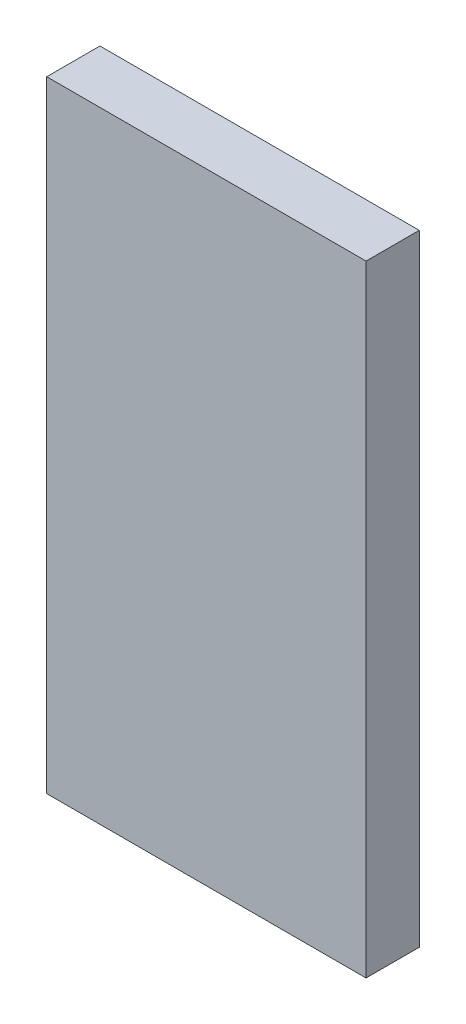
ISO-10303-21;
HEADER;
FILE_DESCRIPTION(('STEP AP214'),'2;1');
FILE_NAME('part.step','',(''),(''),'','','');
FILE_SCHEMA(('AUTOMOTIVE_DESIGN { 1 0 10303 214 1 1 1 1 }'));
ENDSEC;
DATA;
#1=APPLICATION_CONTEXT('core data for automotive mechanical design processes');
#2=APPLICATION_PROTOCOL_DEFINITION('international standard','automotive_design',2000,#1);
#3=PRODUCT_CONTEXT('',#1,'mechanical');
#4=PRODUCT('Part','Part','',(#3));
#5=PRODUCT_RELATED_PRODUCT_CATEGORY('part','',(#4));
#6=PRODUCT_DEFINITION_FORMATION('','',#4);
#7=PRODUCT_DEFINITION_CONTEXT('part definition',#1,'design');
#8=PRODUCT_DEFINITION('design','',#6,#7);
#9=PRODUCT_DEFINITION_SHAPE('','',#8);
#10=(LENGTH_UNIT() NAMED_UNIT(*) SI_UNIT(.MILLI.,.METRE.));
#11=(NAMED_UNIT(*) PLANE_ANGLE_UNIT() SI_UNIT($,.RADIAN.));
#12=(NAMED_UNIT(*) SI_UNIT($,.STERADIAN.) SOLID_ANGLE_UNIT());
#13=UNCERTAINTY_MEASURE_WITH_UNIT(LENGTH_MEASURE(1.E-05),#10,'distance_accuracy_value','');
#14=(GEOMETRIC_REPRESENTATION_CONTEXT(3) GLOBAL_UNCERTAINTY_ASSIGNED_CONTEXT((#13)) GLOBAL_UNIT_ASSIGNED_CONTEXT((#10,
#11,#12)) REPRESENTATION_CONTEXT('',''));
#15=CARTESIAN_POINT('',(0.,0.,0.));
#16=DIRECTION('',(0.,0.,1.));
#17=DIRECTION('',(1.,0.,0.));
#18=AXIS2_PLACEMENT_3D('',#15,#16,#17);
#19=CARTESIAN_POINT('',(0.,35.0000000001836,3.));
#20=DIRECTION('',(0.,-1.,0.));
#21=DIRECTION('',(0.,0.,-1.));
#22=AXIS2_PLACEMENT_3D('',#19,#20,#21);
#23=PLANE('',#22);
#24=DIRECTION('',(-1.,0.,0.));
#25=VECTOR('',#24,1.);
#26=CARTESIAN_POINT('',(0.,35.0000000001836,0.));
#27=LINE('',#26,#25);
#28=CARTESIAN_POINT('',(18.,35.0000000001836,0.));
#29=VERTEX_POINT('',#28);
#30=CARTESIAN_POINT('',(0.,35.0000000001836,0.));
#31=VERTEX_POINT('',#30);
#32=EDGE_CURVE('E96',#29,#31,#27,.T.);
#33=ORIENTED_EDGE('',*,*,#32,.T.);
#34=DIRECTION('',(0.,0.,-1.));
#35=VECTOR('',#34,1.);
#36=CARTESIAN_POINT('',(0.,35.0000000001836,3.));
#37=LINE('',#36,#35);
#38=CARTESIAN_POINT('',(0.,35.0000000001836,3.));
#39=VERTEX_POINT('',#38);
#40=EDGE_CURVE('E11',#39,#31,#37,.T.);
#41=ORIENTED_EDGE('',*,*,#40,.F.);
#42=DIRECTION('',(-1.,0.,0.));
#43=VECTOR('',#42,1.);
#44=CARTESIAN_POINT('',(0.,35.0000000001836,3.));
#45=LINE('',#44,#43);
#46=CARTESIAN_POINT('',(18.,35.0000000001836,3.));
#47=VERTEX_POINT('',#46);
#48=EDGE_CURVE('E84',#47,#39,#45,.T.);
#49=ORIENTED_EDGE('',*,*,#48,.F.);
#50=DIRECTION('',(0.,0.,-1.));
#51=VECTOR('',#50,1.);
#52=CARTESIAN_POINT('',(18.,35.0000000001836,3.));
#53=LINE('',#52,#51);
#54=EDGE_CURVE('E92',#47,#29,#53,.T.);
#55=ORIENTED_EDGE('',*,*,#54,.T.);
#56=EDGE_LOOP('',(#33,#41,#49,#55));
#57=FACE_BOUND('',#56,.T.);
#58=ADVANCED_FACE('F33',(#57),#23,.F.);
#59=CARTESIAN_POINT('',(0.,35.0000000001836,3.));
#60=DIRECTION('',(1.,0.,0.));
#61=DIRECTION('',(0.,1.,0.));
#62=AXIS2_PLACEMENT_3D('',#59,#60,#61);
#63=PLANE('',#62);
#64=DIRECTION('',(0.,-1.,0.));
#65=VECTOR('',#64,1.);
#66=CARTESIAN_POINT('',(0.,35.0000000001836,0.));
#67=LINE('',#66,#65);
#68=CARTESIAN_POINT('',(0.,0.,0.));
#69=VERTEX_POINT('',#68);
#70=EDGE_CURVE('E88',#31,#69,#67,.T.);
#71=ORIENTED_EDGE('',*,*,#70,.T.);
#72=DIRECTION('',(0.,0.,-1.));
#73=VECTOR('',#72,1.);
#74=CARTESIAN_POINT('',(0.,0.,3.));
#75=LINE('',#74,#73);
#76=CARTESIAN_POINT('',(0.,0.,3.));
#77=VERTEX_POINT('',#76);
#78=EDGE_CURVE('E41',#77,#69,#75,.T.);
#79=ORIENTED_EDGE('',*,*,#78,.F.);
#80=DIRECTION('',(0.,-1.,0.));
#81=VECTOR('',#80,1.);
#82=CARTESIAN_POINT('',(0.,35.0000000001836,3.));
#83=LINE('',#82,#81);
#84=EDGE_CURVE('E79',#39,#77,#83,.T.);
#85=ORIENTED_EDGE('',*,*,#84,.F.);
#86=ORIENTED_EDGE('',*,*,#40,.T.);
#87=EDGE_LOOP('',(#71,#79,#85,#86));
#88=FACE_BOUND('',#87,.T.);
#89=ADVANCED_FACE('F87',(#88),#63,.F.);
#90=CARTESIAN_POINT('',(18.,0.,3.));
#91=DIRECTION('',(0.,1.,0.));
#92=DIRECTION('',(-1.,0.,0.));
#93=AXIS2_PLACEMENT_3D('',#90,#91,#92);
#94=PLANE('',#93);
#95=DIRECTION('',(1.,0.,0.));
#96=VECTOR('',#95,1.);
#97=CARTESIAN_POINT('',(18.,0.,0.));
#98=LINE('',#97,#96);
#99=CARTESIAN_POINT('',(18.,0.,0.));
#100=VERTEX_POINT('',#99);
#101=EDGE_CURVE('E66',#69,#100,#98,.T.);
#102=ORIENTED_EDGE('',*,*,#101,.T.);
#103=DIRECTION('',(0.,0.,-1.));
#104=VECTOR('',#103,1.);
#105=CARTESIAN_POINT('',(18.,0.,3.));
#106=LINE('',#105,#104);
#107=CARTESIAN_POINT('',(18.,0.,3.));
#108=VERTEX_POINT('',#107);
#109=EDGE_CURVE('E89',#108,#100,#106,.T.);
#110=ORIENTED_EDGE('',*,*,#109,.F.);
#111=DIRECTION('',(1.,0.,0.));
#112=VECTOR('',#111,1.);
#113=CARTESIAN_POINT('',(18.,0.,3.));
#114=LINE('',#113,#112);
#115=EDGE_CURVE('E82',#77,#108,#114,.T.);
#116=ORIENTED_EDGE('',*,*,#115,.F.);
#117=ORIENTED_EDGE('',*,*,#78,.T.);
#118=EDGE_LOOP('',(#102,#110,#116,#117));
#119=FACE_BOUND('',#118,.T.);
#120=ADVANCED_FACE('F90',(#119),#94,.F.);
#121=CARTESIAN_POINT('',(18.,35.0000000001836,3.));
#122=DIRECTION('',(-1.,0.,0.));
#123=DIRECTION('',(0.,-1.,0.));
#124=AXIS2_PLACEMENT_3D('',#121,#122,#123);
#125=PLANE('',#124);
#126=DIRECTION('',(0.,1.,0.));
#127=VECTOR('',#126,1.);
#128=CARTESIAN_POINT('',(18.,35.0000000001836,0.));
#129=LINE('',#128,#127);
#130=EDGE_CURVE('E72',#100,#29,#129,.T.);
#131=ORIENTED_EDGE('',*,*,#130,.T.);
#132=ORIENTED_EDGE('',*,*,#54,.F.);
#133=DIRECTION('',(0.,1.,0.));
#134=VECTOR('',#133,1.);
#135=CARTESIAN_POINT('',(18.,35.0000000001836,3.));
#136=LINE('',#135,#134);
#137=EDGE_CURVE('E49',#108,#47,#136,.T.);
#138=ORIENTED_EDGE('',*,*,#137,.F.);
#139=ORIENTED_EDGE('',*,*,#109,.T.);
#140=EDGE_LOOP('',(#131,#132,#138,#139));
#141=FACE_BOUND('',#140,.T.);
#142=ADVANCED_FACE('F103',(#141),#125,.F.);
#143=CARTESIAN_POINT('',(0.,0.,3.));
#144=DIRECTION('',(0.,0.,-1.));
#145=DIRECTION('',(-1.,0.,0.));
#146=AXIS2_PLACEMENT_3D('',#143,#144,#145);
#147=PLANE('',#146);
#148=ORIENTED_EDGE('',*,*,#48,.T.);
#149=ORIENTED_EDGE('',*,*,#84,.T.);
#150=ORIENTED_EDGE('',*,*,#115,.T.);
#151=ORIENTED_EDGE('',*,*,#137,.T.);
#152=EDGE_LOOP('',(#148,#149,#150,#151));
#153=FACE_BOUND('',#152,.T.);
#154=ADVANCED_FACE('F80',(#153),#147,.F.);
#155=CARTESIAN_POINT('',(0.,0.,0.));
#156=DIRECTION('',(0.,0.,-1.));
#157=DIRECTION('',(-1.,0.,0.));
#158=AXIS2_PLACEMENT_3D('',#155,#156,#157);
#159=PLANE('',#158);
#160=ORIENTED_EDGE('',*,*,#32,.F.);
#161=ORIENTED_EDGE('',*,*,#130,.F.);
#162=ORIENTED_EDGE('',*,*,#101,.F.);
#163=ORIENTED_EDGE('',*,*,#70,.F.);
#164=EDGE_LOOP('',(#160,#161,#162,#163));
#165=FACE_BOUND('',#164,.T.);
#166=ADVANCED_FACE('F106',(#165),#159,.T.);
#167=CLOSED_SHELL('',(#58,#89,#120,#142,#154,#166));
#168=MANIFOLD_SOLID_BREP('B2',#167);
#169=ADVANCED_BREP_SHAPE_REPRESENTATION('',(#18,#168),#14);
#170=SHAPE_DEFINITION_REPRESENTATION(#9,#169);
ENDSEC;
END-ISO-10303-21;
